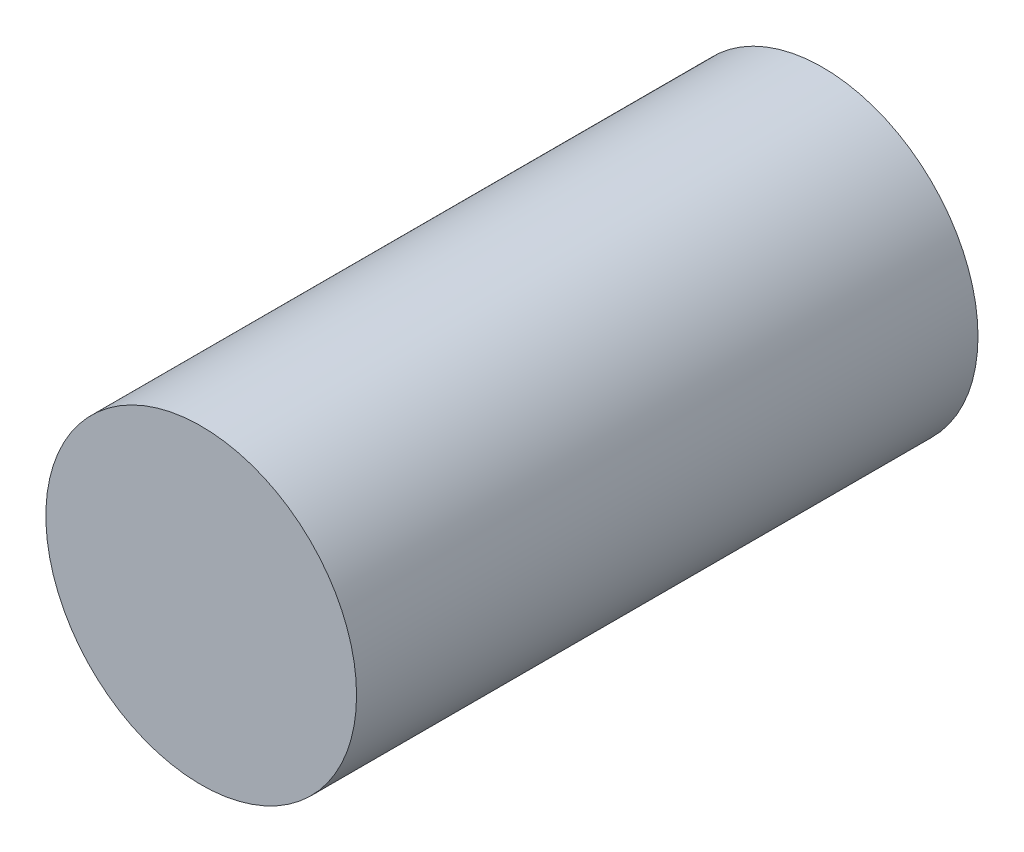
ISO-10303-21;
HEADER;
FILE_DESCRIPTION(('STEP AP214'),'2;1');
FILE_NAME('part.step','',(''),(''),'','','');
FILE_SCHEMA(('AUTOMOTIVE_DESIGN { 1 0 10303 214 1 1 1 1 }'));
ENDSEC;
DATA;
#1=APPLICATION_CONTEXT('core data for automotive mechanical design processes');
#2=APPLICATION_PROTOCOL_DEFINITION('international standard','automotive_design',2000,#1);
#3=PRODUCT_CONTEXT('',#1,'mechanical');
#4=PRODUCT('Part','Part','',(#3));
#5=PRODUCT_RELATED_PRODUCT_CATEGORY('part','',(#4));
#6=PRODUCT_DEFINITION_FORMATION('','',#4);
#7=PRODUCT_DEFINITION_CONTEXT('part definition',#1,'design');
#8=PRODUCT_DEFINITION('design','',#6,#7);
#9=PRODUCT_DEFINITION_SHAPE('','',#8);
#10=(LENGTH_UNIT() NAMED_UNIT(*) SI_UNIT(.MILLI.,.METRE.));
#11=(NAMED_UNIT(*) PLANE_ANGLE_UNIT() SI_UNIT($,.RADIAN.));
#12=(NAMED_UNIT(*) SI_UNIT($,.STERADIAN.) SOLID_ANGLE_UNIT());
#13=UNCERTAINTY_MEASURE_WITH_UNIT(LENGTH_MEASURE(1.E-05),#10,'distance_accuracy_value','');
#14=(GEOMETRIC_REPRESENTATION_CONTEXT(3) GLOBAL_UNCERTAINTY_ASSIGNED_CONTEXT((#13)) GLOBAL_UNIT_ASSIGNED_CONTEXT((#10,
#11,#12)) REPRESENTATION_CONTEXT('',''));
#15=CARTESIAN_POINT('',(0.,0.,0.));
#16=DIRECTION('',(0.,0.,1.));
#17=DIRECTION('',(1.,0.,0.));
#18=AXIS2_PLACEMENT_3D('',#15,#16,#17);
#19=CARTESIAN_POINT('',(0.,0.,101.6));
#20=DIRECTION('',(0.,0.,-1.));
#21=DIRECTION('',(-1.,0.,0.));
#22=AXIS2_PLACEMENT_3D('',#19,#20,#21);
#23=CYLINDRICAL_SURFACE('',#22,25.4);
#24=CARTESIAN_POINT('',(0.,0.,101.6));
#25=DIRECTION('',(0.,0.,1.));
#26=DIRECTION('',(1.,0.,0.));
#27=AXIS2_PLACEMENT_3D('',#24,#25,#26);
#28=CIRCLE('',#27,25.4);
#29=CARTESIAN_POINT('',(25.4,0.,101.6));
#30=VERTEX_POINT('',#29);
#31=EDGE_CURVE('E10',#30,#30,#28,.T.);
#32=ORIENTED_EDGE('',*,*,#31,.F.);
#33=EDGE_LOOP('',(#32));
#34=FACE_BOUND('',#33,.T.);
#35=CARTESIAN_POINT('',(0.,0.,0.));
#36=DIRECTION('',(0.,0.,1.));
#37=DIRECTION('',(1.,0.,0.));
#38=AXIS2_PLACEMENT_3D('',#35,#36,#37);
#39=CIRCLE('',#38,25.4);
#40=CARTESIAN_POINT('',(25.4,0.,0.));
#41=VERTEX_POINT('',#40);
#42=EDGE_CURVE('E40',#41,#41,#39,.T.);
#43=ORIENTED_EDGE('',*,*,#42,.T.);
#44=EDGE_LOOP('',(#43));
#45=FACE_BOUND('',#44,.T.);
#46=ADVANCED_FACE('F37',(#34,#45),#23,.T.);
#47=CARTESIAN_POINT('',(0.,0.,101.6));
#48=DIRECTION('',(0.,0.,1.));
#49=DIRECTION('',(1.,0.,0.));
#50=AXIS2_PLACEMENT_3D('',#47,#48,#49);
#51=PLANE('',#50);
#52=ORIENTED_EDGE('',*,*,#31,.T.);
#53=EDGE_LOOP('',(#52));
#54=FACE_BOUND('',#53,.T.);
#55=ADVANCED_FACE('F52',(#54),#51,.T.);
#56=CARTESIAN_POINT('',(0.,0.,0.));
#57=DIRECTION('',(0.,0.,1.));
#58=DIRECTION('',(1.,0.,0.));
#59=AXIS2_PLACEMENT_3D('',#56,#57,#58);
#60=PLANE('',#59);
#61=ORIENTED_EDGE('',*,*,#42,.F.);
#62=EDGE_LOOP('',(#61));
#63=FACE_BOUND('',#62,.T.);
#64=ADVANCED_FACE('F50',(#63),#60,.F.);
#65=CLOSED_SHELL('',(#46,#55,#64));
#66=MANIFOLD_SOLID_BREP('B2',#65);
#67=ADVANCED_BREP_SHAPE_REPRESENTATION('',(#18,#66),#14);
#68=SHAPE_DEFINITION_REPRESENTATION(#9,#67);
ENDSEC;
END-ISO-10303-21;
